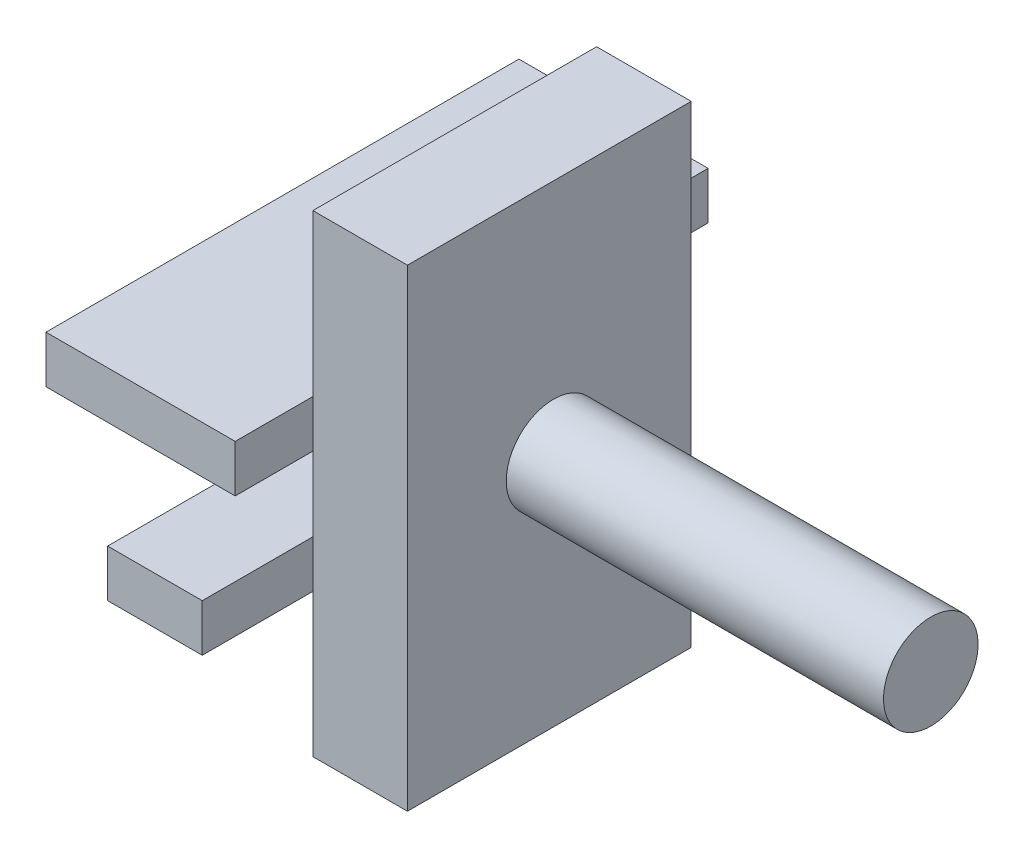
ISO-10303-21;
HEADER;
FILE_DESCRIPTION(('STEP AP214'),'2;1');
FILE_NAME('part.step','',(''),(''),'','','');
FILE_SCHEMA(('AUTOMOTIVE_DESIGN { 1 0 10303 214 1 1 1 1 }'));
ENDSEC;
DATA;
#1=APPLICATION_CONTEXT('core data for automotive mechanical design processes');
#2=APPLICATION_PROTOCOL_DEFINITION('international standard','automotive_design',2000,#1);
#3=PRODUCT_CONTEXT('',#1,'mechanical');
#4=PRODUCT('Part','Part','',(#3));
#5=PRODUCT_RELATED_PRODUCT_CATEGORY('part','',(#4));
#6=PRODUCT_DEFINITION_FORMATION('','',#4);
#7=PRODUCT_DEFINITION_CONTEXT('part definition',#1,'design');
#8=PRODUCT_DEFINITION('design','',#6,#7);
#9=PRODUCT_DEFINITION_SHAPE('','',#8);
#10=(LENGTH_UNIT() NAMED_UNIT(*) SI_UNIT(.MILLI.,.METRE.));
#11=(NAMED_UNIT(*) PLANE_ANGLE_UNIT() SI_UNIT($,.RADIAN.));
#12=(NAMED_UNIT(*) SI_UNIT($,.STERADIAN.) SOLID_ANGLE_UNIT());
#13=UNCERTAINTY_MEASURE_WITH_UNIT(LENGTH_MEASURE(1.E-05),#10,'distance_accuracy_value','');
#14=(GEOMETRIC_REPRESENTATION_CONTEXT(3) GLOBAL_UNCERTAINTY_ASSIGNED_CONTEXT((#13)) GLOBAL_UNIT_ASSIGNED_CONTEXT((#10,
#11,#12)) REPRESENTATION_CONTEXT('',''));
#15=CARTESIAN_POINT('',(0.,0.,0.));
#16=DIRECTION('',(0.,0.,1.));
#17=DIRECTION('',(1.,0.,0.));
#18=AXIS2_PLACEMENT_3D('',#15,#16,#17);
#19=CARTESIAN_POINT('',(12.892881308441,-3.34735781874821,51.5878251474294));
#20=DIRECTION('',(0.,1.,0.));
#21=DIRECTION('',(-1.,0.,0.));
#22=AXIS2_PLACEMENT_3D('',#19,#20,#21);
#23=PLANE('',#22);
#24=DIRECTION('',(0.,0.,-1.));
#25=VECTOR('',#24,1.);
#26=CARTESIAN_POINT('',(2.89288130844102,-3.34735781874824,51.5878251474294));
#27=LINE('',#26,#25);
#28=CARTESIAN_POINT('',(2.89288130844102,-3.34735781874824,51.5878251474294));
#29=VERTEX_POINT('',#28);
#30=CARTESIAN_POINT('',(2.89288130844102,-3.34735781874814,21.5878251474294));
#31=VERTEX_POINT('',#30);
#32=EDGE_CURVE('P0_E80',#29,#31,#27,.T.);
#33=ORIENTED_EDGE('',*,*,#32,.T.);
#34=DIRECTION('',(-1.,0.,0.));
#35=VECTOR('',#34,1.);
#36=CARTESIAN_POINT('',(12.892881308441,-3.34735781874811,21.5878251474294));
#37=LINE('',#36,#35);
#38=CARTESIAN_POINT('',(12.892881308441,-3.34735781874811,21.5878251474294));
#39=VERTEX_POINT('',#38);
#40=EDGE_CURVE('P0_E11',#39,#31,#37,.T.);
#41=ORIENTED_EDGE('',*,*,#40,.F.);
#42=DIRECTION('',(0.,0.,-1.));
#43=VECTOR('',#42,1.);
#44=CARTESIAN_POINT('',(12.892881308441,-3.34735781874821,51.5878251474294));
#45=LINE('',#44,#43);
#46=CARTESIAN_POINT('',(12.892881308441,-3.34735781874821,51.5878251474294));
#47=VERTEX_POINT('',#46);
#48=EDGE_CURVE('P0_E68',#47,#39,#45,.T.);
#49=ORIENTED_EDGE('',*,*,#48,.F.);
#50=DIRECTION('',(-1.,0.,0.));
#51=VECTOR('',#50,1.);
#52=CARTESIAN_POINT('',(12.892881308441,-3.34735781874821,51.5878251474294));
#53=LINE('',#52,#51);
#54=EDGE_CURVE('P0_E76',#47,#29,#53,.T.);
#55=ORIENTED_EDGE('',*,*,#54,.T.);
#56=EDGE_LOOP('',(#33,#41,#49,#55));
#57=FACE_BOUND('',#56,.T.);
#58=ADVANCED_FACE('P0_F17',(#57),#23,.F.);
#59=CARTESIAN_POINT('',(12.892881308441,-3.34735781874811,21.5878251474294));
#60=DIRECTION('',(0.,0.,1.));
#61=DIRECTION('',(0.,-1.,0.));
#62=AXIS2_PLACEMENT_3D('',#59,#60,#61);
#63=PLANE('',#62);
#64=DIRECTION('',(0.,1.,0.));
#65=VECTOR('',#64,1.);
#66=CARTESIAN_POINT('',(2.89288130844102,-3.34735781874814,21.5878251474294));
#67=LINE('',#66,#65);
#68=CARTESIAN_POINT('',(2.89288130844085,46.6526421812519,21.5878251474296));
#69=VERTEX_POINT('',#68);
#70=EDGE_CURVE('P0_E72',#31,#69,#67,.T.);
#71=ORIENTED_EDGE('',*,*,#70,.T.);
#72=DIRECTION('',(-1.,0.,0.));
#73=VECTOR('',#72,1.);
#74=CARTESIAN_POINT('',(12.8928813084408,46.6526421812519,21.5878251474296));
#75=LINE('',#74,#73);
#76=CARTESIAN_POINT('',(12.8928813084408,46.6526421812519,21.5878251474296));
#77=VERTEX_POINT('',#76);
#78=EDGE_CURVE('P0_E25',#77,#69,#75,.T.);
#79=ORIENTED_EDGE('',*,*,#78,.F.);
#80=DIRECTION('',(0.,1.,0.));
#81=VECTOR('',#80,1.);
#82=CARTESIAN_POINT('',(12.892881308441,-3.34735781874811,21.5878251474294));
#83=LINE('',#82,#81);
#84=EDGE_CURVE('P0_E63',#39,#77,#83,.T.);
#85=ORIENTED_EDGE('',*,*,#84,.F.);
#86=ORIENTED_EDGE('',*,*,#40,.T.);
#87=EDGE_LOOP('',(#71,#79,#85,#86));
#88=FACE_BOUND('',#87,.T.);
#89=ADVANCED_FACE('P0_F71',(#88),#63,.F.);
#90=CARTESIAN_POINT('',(12.8928813084408,46.6526421812518,51.5878251474296));
#91=DIRECTION('',(0.,-1.,0.));
#92=DIRECTION('',(1.,0.,0.));
#93=AXIS2_PLACEMENT_3D('',#90,#91,#92);
#94=PLANE('',#93);
#95=DIRECTION('',(0.,0.,1.));
#96=VECTOR('',#95,1.);
#97=CARTESIAN_POINT('',(2.89288130844085,46.6526421812518,51.5878251474296));
#98=LINE('',#97,#96);
#99=CARTESIAN_POINT('',(2.89288130844085,46.6526421812518,51.5878251474296));
#100=VERTEX_POINT('',#99);
#101=EDGE_CURVE('P0_E50',#69,#100,#98,.T.);
#102=ORIENTED_EDGE('',*,*,#101,.T.);
#103=DIRECTION('',(-1.,0.,0.));
#104=VECTOR('',#103,1.);
#105=CARTESIAN_POINT('',(12.8928813084408,46.6526421812518,51.5878251474296));
#106=LINE('',#105,#104);
#107=CARTESIAN_POINT('',(12.8928813084408,46.6526421812518,51.5878251474296));
#108=VERTEX_POINT('',#107);
#109=EDGE_CURVE('P0_E73',#108,#100,#106,.T.);
#110=ORIENTED_EDGE('',*,*,#109,.F.);
#111=DIRECTION('',(0.,0.,1.));
#112=VECTOR('',#111,1.);
#113=CARTESIAN_POINT('',(12.8928813084408,46.6526421812518,51.5878251474296));
#114=LINE('',#113,#112);
#115=EDGE_CURVE('P0_E66',#77,#108,#114,.T.);
#116=ORIENTED_EDGE('',*,*,#115,.F.);
#117=ORIENTED_EDGE('',*,*,#78,.T.);
#118=EDGE_LOOP('',(#102,#110,#116,#117));
#119=FACE_BOUND('',#118,.T.);
#120=ADVANCED_FACE('P0_F74',(#119),#94,.F.);
#121=CARTESIAN_POINT('',(12.892881308441,-3.34735781874821,51.5878251474294));
#122=DIRECTION('',(0.,0.,-1.));
#123=DIRECTION('',(-1.,0.,0.));
#124=AXIS2_PLACEMENT_3D('',#121,#122,#123);
#125=PLANE('',#124);
#126=DIRECTION('',(0.,-1.,0.));
#127=VECTOR('',#126,1.);
#128=CARTESIAN_POINT('',(2.89288130844102,-3.34735781874824,51.5878251474294));
#129=LINE('',#128,#127);
#130=EDGE_CURVE('P0_E56',#100,#29,#129,.T.);
#131=ORIENTED_EDGE('',*,*,#130,.T.);
#132=ORIENTED_EDGE('',*,*,#54,.F.);
#133=DIRECTION('',(0.,-1.,0.));
#134=VECTOR('',#133,1.);
#135=CARTESIAN_POINT('',(12.892881308441,-3.34735781874821,51.5878251474294));
#136=LINE('',#135,#134);
#137=EDGE_CURVE('P0_E33',#108,#47,#136,.T.);
#138=ORIENTED_EDGE('',*,*,#137,.F.);
#139=ORIENTED_EDGE('',*,*,#109,.T.);
#140=EDGE_LOOP('',(#131,#132,#138,#139));
#141=FACE_BOUND('',#140,.T.);
#142=ADVANCED_FACE('P0_F88',(#141),#125,.F.);
#143=CARTESIAN_POINT('',(12.892881308441,-1.30876863733646,51.5878251474294));
#144=DIRECTION('',(1.,0.,0.));
#145=DIRECTION('',(0.,1.,0.));
#146=AXIS2_PLACEMENT_3D('',#143,#144,#145);
#147=PLANE('',#146);
#148=CARTESIAN_POINT('',(12.8928813084409,21.6593369422146,36.1397737543822));
#149=DIRECTION('',(1.,0.,0.));
#150=DIRECTION('',(0.,1.,0.));
#151=AXIS2_PLACEMENT_3D('',#148,#149,#150);
#152=CIRCLE('',#151,2.5);
#153=CARTESIAN_POINT('',(12.8928813084409,24.1593369422146,36.1397737543822));
#154=VERTEX_POINT('',#153);
#155=EDGE_CURVE('P0_E94',#154,#154,#152,.T.);
#156=ORIENTED_EDGE('',*,*,#155,.F.);
#157=EDGE_LOOP('',(#156));
#158=FACE_BOUND('',#157,.T.);
#159=ORIENTED_EDGE('',*,*,#48,.T.);
#160=ORIENTED_EDGE('',*,*,#84,.T.);
#161=ORIENTED_EDGE('',*,*,#115,.T.);
#162=ORIENTED_EDGE('',*,*,#137,.T.);
#163=EDGE_LOOP('',(#159,#160,#161,#162));
#164=FACE_BOUND('',#163,.T.);
#165=ADVANCED_FACE('P0_F64',(#158,#164),#147,.T.);
#166=CARTESIAN_POINT('',(2.89288130844102,-1.30876863733649,51.5878251474294));
#167=DIRECTION('',(1.,0.,0.));
#168=DIRECTION('',(0.,1.,0.));
#169=AXIS2_PLACEMENT_3D('',#166,#167,#168);
#170=PLANE('',#169);
#171=CARTESIAN_POINT('',(2.89288130844094,21.6593369422145,36.1397737543822));
#172=DIRECTION('',(1.,0.,0.));
#173=DIRECTION('',(0.,1.,0.));
#174=AXIS2_PLACEMENT_3D('',#171,#172,#173);
#175=CIRCLE('',#174,2.5);
#176=CARTESIAN_POINT('',(2.89288130844093,24.1593369422145,36.1397737543822));
#177=VERTEX_POINT('',#176);
#178=EDGE_CURVE('P0_E83',#177,#177,#175,.T.);
#179=ORIENTED_EDGE('',*,*,#178,.T.);
#180=EDGE_LOOP('',(#179));
#181=FACE_BOUND('',#180,.T.);
#182=ORIENTED_EDGE('',*,*,#32,.F.);
#183=ORIENTED_EDGE('',*,*,#130,.F.);
#184=ORIENTED_EDGE('',*,*,#101,.F.);
#185=ORIENTED_EDGE('',*,*,#70,.F.);
#186=EDGE_LOOP('',(#182,#183,#184,#185));
#187=FACE_BOUND('',#186,.T.);
#188=ADVANCED_FACE('P0_F91',(#181,#187),#170,.F.);
#189=CARTESIAN_POINT('',(2.89288130844094,21.6593369422145,36.1397737543822));
#190=DIRECTION('',(1.,0.,0.));
#191=DIRECTION('',(0.,1.,0.));
#192=AXIS2_PLACEMENT_3D('',#189,#190,#191);
#193=CYLINDRICAL_SURFACE('',#192,2.5);
#194=ORIENTED_EDGE('',*,*,#178,.F.);
#195=EDGE_LOOP('',(#194));
#196=FACE_BOUND('',#195,.T.);
#197=ORIENTED_EDGE('',*,*,#155,.T.);
#198=EDGE_LOOP('',(#197));
#199=FACE_BOUND('',#198,.T.);
#200=ADVANCED_FACE('P0_F101',(#196,#199),#193,.F.);
#201=CLOSED_SHELL('',(#58,#89,#120,#142,#165,#188,#200));
#202=MANIFOLD_SOLID_BREP('P0_B1',#201);
#203=CARTESIAN_POINT('',(-17.1071186915591,29.6253206980531,59.8005578846722));
#204=DIRECTION('',(0.,0.,-1.));
#205=DIRECTION('',(0.,-1.,0.));
#206=AXIS2_PLACEMENT_3D('',#203,#204,#205);
#207=PLANE('',#206);
#208=DIRECTION('',(1.,0.,0.));
#209=VECTOR('',#208,1.);
#210=CARTESIAN_POINT('',(-17.1071186915591,24.6253206980531,59.8005578846722));
#211=LINE('',#210,#209);
#212=CARTESIAN_POINT('',(-17.1071186915591,24.6253206980531,59.8005578846722));
#213=VERTEX_POINT('',#212);
#214=CARTESIAN_POINT('',(2.89288130844093,24.6253206980532,59.8005578846722));
#215=VERTEX_POINT('',#214);
#216=EDGE_CURVE('P1_E79',#213,#215,#211,.T.);
#217=ORIENTED_EDGE('',*,*,#216,.T.);
#218=DIRECTION('',(0.,-1.,0.));
#219=VECTOR('',#218,1.);
#220=CARTESIAN_POINT('',(2.89288130844091,29.6253206980532,59.8005578846722));
#221=LINE('',#220,#219);
#222=CARTESIAN_POINT('',(2.89288130844091,29.6253206980532,59.8005578846722));
#223=VERTEX_POINT('',#222);
#224=EDGE_CURVE('P1_E10',#223,#215,#221,.T.);
#225=ORIENTED_EDGE('',*,*,#224,.F.);
#226=DIRECTION('',(1.,0.,0.));
#227=VECTOR('',#226,1.);
#228=CARTESIAN_POINT('',(-17.1071186915591,29.6253206980531,59.8005578846722));
#229=LINE('',#228,#227);
#230=CARTESIAN_POINT('',(-17.1071186915591,29.6253206980531,59.8005578846722));
#231=VERTEX_POINT('',#230);
#232=EDGE_CURVE('P1_E67',#231,#223,#229,.T.);
#233=ORIENTED_EDGE('',*,*,#232,.F.);
#234=DIRECTION('',(0.,-1.,0.));
#235=VECTOR('',#234,1.);
#236=CARTESIAN_POINT('',(-17.1071186915591,29.6253206980531,59.8005578846722));
#237=LINE('',#236,#235);
#238=EDGE_CURVE('P1_E75',#231,#213,#237,.T.);
#239=ORIENTED_EDGE('',*,*,#238,.T.);
#240=EDGE_LOOP('',(#217,#225,#233,#239));
#241=FACE_BOUND('',#240,.T.);
#242=ADVANCED_FACE('P1_F16',(#241),#207,.F.);
#243=CARTESIAN_POINT('',(2.89288130844091,29.6253206980532,59.8005578846722));
#244=DIRECTION('',(-1.,0.,0.));
#245=DIRECTION('',(0.,1.,0.));
#246=AXIS2_PLACEMENT_3D('',#243,#244,#245);
#247=PLANE('',#246);
#248=DIRECTION('',(0.,0.,-1.));
#249=VECTOR('',#248,1.);
#250=CARTESIAN_POINT('',(2.89288130844093,24.6253206980532,59.8005578846722));
#251=LINE('',#250,#249);
#252=CARTESIAN_POINT('',(2.89288130844093,24.625320698053,9.80055788467222));
#253=VERTEX_POINT('',#252);
#254=EDGE_CURVE('P1_E71',#215,#253,#251,.T.);
#255=ORIENTED_EDGE('',*,*,#254,.T.);
#256=DIRECTION('',(0.,-1.,0.));
#257=VECTOR('',#256,1.);
#258=CARTESIAN_POINT('',(2.89288130844091,29.625320698053,9.8005578846722));
#259=LINE('',#258,#257);
#260=CARTESIAN_POINT('',(2.89288130844091,29.625320698053,9.8005578846722));
#261=VERTEX_POINT('',#260);
#262=EDGE_CURVE('P1_E24',#261,#253,#259,.T.);
#263=ORIENTED_EDGE('',*,*,#262,.F.);
#264=DIRECTION('',(0.,0.,-1.));
#265=VECTOR('',#264,1.);
#266=CARTESIAN_POINT('',(2.89288130844091,29.6253206980532,59.8005578846722));
#267=LINE('',#266,#265);
#268=EDGE_CURVE('P1_E62',#223,#261,#267,.T.);
#269=ORIENTED_EDGE('',*,*,#268,.F.);
#270=ORIENTED_EDGE('',*,*,#224,.T.);
#271=EDGE_LOOP('',(#255,#263,#269,#270));
#272=FACE_BOUND('',#271,.T.);
#273=ADVANCED_FACE('P1_F70',(#272),#247,.F.);
#274=CARTESIAN_POINT('',(-17.1071186915591,29.6253206980529,9.8005578846722));
#275=DIRECTION('',(0.,0.,1.));
#276=DIRECTION('',(0.,1.,0.));
#277=AXIS2_PLACEMENT_3D('',#274,#275,#276);
#278=PLANE('',#277);
#279=DIRECTION('',(-1.,0.,0.));
#280=VECTOR('',#279,1.);
#281=CARTESIAN_POINT('',(-17.1071186915591,24.6253206980529,9.80055788467222));
#282=LINE('',#281,#280);
#283=CARTESIAN_POINT('',(-17.1071186915591,24.6253206980529,9.80055788467222));
#284=VERTEX_POINT('',#283);
#285=EDGE_CURVE('P1_E49',#253,#284,#282,.T.);
#286=ORIENTED_EDGE('',*,*,#285,.T.);
#287=DIRECTION('',(0.,-1.,0.));
#288=VECTOR('',#287,1.);
#289=CARTESIAN_POINT('',(-17.1071186915591,29.6253206980529,9.8005578846722));
#290=LINE('',#289,#288);
#291=CARTESIAN_POINT('',(-17.1071186915591,29.6253206980529,9.8005578846722));
#292=VERTEX_POINT('',#291);
#293=EDGE_CURVE('P1_E72',#292,#284,#290,.T.);
#294=ORIENTED_EDGE('',*,*,#293,.F.);
#295=DIRECTION('',(-1.,0.,0.));
#296=VECTOR('',#295,1.);
#297=CARTESIAN_POINT('',(-17.1071186915591,29.6253206980529,9.8005578846722));
#298=LINE('',#297,#296);
#299=EDGE_CURVE('P1_E65',#261,#292,#298,.T.);
#300=ORIENTED_EDGE('',*,*,#299,.F.);
#301=ORIENTED_EDGE('',*,*,#262,.T.);
#302=EDGE_LOOP('',(#286,#294,#300,#301));
#303=FACE_BOUND('',#302,.T.);
#304=ADVANCED_FACE('P1_F73',(#303),#278,.F.);
#305=CARTESIAN_POINT('',(-17.1071186915591,29.6253206980531,59.8005578846722));
#306=DIRECTION('',(1.,0.,0.));
#307=DIRECTION('',(0.,-1.,0.));
#308=AXIS2_PLACEMENT_3D('',#305,#306,#307);
#309=PLANE('',#308);
#310=DIRECTION('',(0.,0.,1.));
#311=VECTOR('',#310,1.);
#312=CARTESIAN_POINT('',(-17.1071186915591,24.6253206980531,59.8005578846722));
#313=LINE('',#312,#311);
#314=EDGE_CURVE('P1_E55',#284,#213,#313,.T.);
#315=ORIENTED_EDGE('',*,*,#314,.T.);
#316=ORIENTED_EDGE('',*,*,#238,.F.);
#317=DIRECTION('',(0.,0.,1.));
#318=VECTOR('',#317,1.);
#319=CARTESIAN_POINT('',(-17.1071186915591,29.6253206980531,59.8005578846722));
#320=LINE('',#319,#318);
#321=EDGE_CURVE('P1_E32',#292,#231,#320,.T.);
#322=ORIENTED_EDGE('',*,*,#321,.F.);
#323=ORIENTED_EDGE('',*,*,#293,.T.);
#324=EDGE_LOOP('',(#315,#316,#322,#323));
#325=FACE_BOUND('',#324,.T.);
#326=ADVANCED_FACE('P1_F86',(#325),#309,.F.);
#327=CARTESIAN_POINT('',(-17.1071186915591,29.6253206980531,59.8005578846722));
#328=DIRECTION('',(0.,1.,0.));
#329=DIRECTION('',(0.,0.,-1.));
#330=AXIS2_PLACEMENT_3D('',#327,#328,#329);
#331=PLANE('',#330);
#332=ORIENTED_EDGE('',*,*,#232,.T.);
#333=ORIENTED_EDGE('',*,*,#268,.T.);
#334=ORIENTED_EDGE('',*,*,#299,.T.);
#335=ORIENTED_EDGE('',*,*,#321,.T.);
#336=EDGE_LOOP('',(#332,#333,#334,#335));
#337=FACE_BOUND('',#336,.T.);
#338=ADVANCED_FACE('P1_F63',(#337),#331,.T.);
#339=CARTESIAN_POINT('',(-17.1071186915591,24.6253206980531,59.8005578846722));
#340=DIRECTION('',(0.,1.,0.));
#341=DIRECTION('',(0.,0.,-1.));
#342=AXIS2_PLACEMENT_3D('',#339,#340,#341);
#343=PLANE('',#342);
#344=ORIENTED_EDGE('',*,*,#216,.F.);
#345=ORIENTED_EDGE('',*,*,#314,.F.);
#346=ORIENTED_EDGE('',*,*,#285,.F.);
#347=ORIENTED_EDGE('',*,*,#254,.F.);
#348=EDGE_LOOP('',(#344,#345,#346,#347));
#349=FACE_BOUND('',#348,.T.);
#350=ADVANCED_FACE('P1_F89',(#349),#343,.F.);
#351=CLOSED_SHELL('',(#242,#273,#304,#326,#338,#350));
#352=MANIFOLD_SOLID_BREP('P1_B1',#351);
#353=CARTESIAN_POINT('',(2.77510659368166,21.6593369422145,36.1397737543822));
#354=DIRECTION('',(-1.,0.,0.));
#355=DIRECTION('',(0.,-0.717446984380104,-0.696613109698558));
#356=AXIS2_PLACEMENT_3D('',#353,#354,#355);
#357=CYLINDRICAL_SURFACE('',#356,5.);
#358=CARTESIAN_POINT('',(52.7751065936817,21.6593369422147,36.1397737543822));
#359=DIRECTION('',(-1.,0.,0.));
#360=DIRECTION('',(0.,-0.717446984380104,-0.696613109698558));
#361=AXIS2_PLACEMENT_3D('',#358,#359,#360);
#362=CIRCLE('',#361,5.);
#363=CARTESIAN_POINT('',(52.7751065936817,18.0721020203142,32.6567082058894));
#364=VERTEX_POINT('',#363);
#365=EDGE_CURVE('P2_E21',#364,#364,#362,.T.);
#366=ORIENTED_EDGE('',*,*,#365,.T.);
#367=EDGE_LOOP('',(#366));
#368=FACE_BOUND('',#367,.T.);
#369=CARTESIAN_POINT('',(2.77510659368166,21.6593369422145,36.1397737543822));
#370=DIRECTION('',(-1.,0.,0.));
#371=DIRECTION('',(0.,-0.717446984380104,-0.696613109698558));
#372=AXIS2_PLACEMENT_3D('',#369,#370,#371);
#373=CIRCLE('',#372,5.);
#374=CARTESIAN_POINT('',(2.77510659368168,18.072102020314,32.6567082058894));
#375=VERTEX_POINT('',#374);
#376=EDGE_CURVE('P2_E10',#375,#375,#373,.T.);
#377=ORIENTED_EDGE('',*,*,#376,.F.);
#378=EDGE_LOOP('',(#377));
#379=FACE_BOUND('',#378,.T.);
#380=ADVANCED_FACE('P2_F15',(#368,#379),#357,.T.);
#381=CARTESIAN_POINT('',(2.77510659368165,25.1424024907073,32.5525388324817));
#382=DIRECTION('',(1.,0.,0.));
#383=DIRECTION('',(0.,0.717446984380104,0.696613109698558));
#384=AXIS2_PLACEMENT_3D('',#381,#382,#383);
#385=PLANE('',#384);
#386=ORIENTED_EDGE('',*,*,#376,.T.);
#387=EDGE_LOOP('',(#386));
#388=FACE_BOUND('',#387,.T.);
#389=ADVANCED_FACE('P2_F31',(#388),#385,.F.);
#390=CARTESIAN_POINT('',(52.7751065936817,21.6593369422147,36.1397737543822));
#391=DIRECTION('',(-1.,0.,0.));
#392=DIRECTION('',(0.,-0.717446984380104,-0.696613109698558));
#393=AXIS2_PLACEMENT_3D('',#390,#391,#392);
#394=PLANE('',#393);
#395=ORIENTED_EDGE('',*,*,#365,.F.);
#396=EDGE_LOOP('',(#395));
#397=FACE_BOUND('',#396,.T.);
#398=ADVANCED_FACE('P2_F29',(#397),#394,.F.);
#399=CLOSED_SHELL('',(#380,#389,#398));
#400=MANIFOLD_SOLID_BREP('P2_B1',#399);
#401=CARTESIAN_POINT('',(-7.10711869155905,16.7811179146093,63.2818628801897));
#402=DIRECTION('',(0.,0.,-1.));
#403=DIRECTION('',(0.,-1.,0.));
#404=AXIS2_PLACEMENT_3D('',#401,#402,#403);
#405=PLANE('',#404);
#406=DIRECTION('',(1.,0.,0.));
#407=VECTOR('',#406,1.);
#408=CARTESIAN_POINT('',(-7.10711869155903,11.7811179146093,63.2818628801897));
#409=LINE('',#408,#407);
#410=CARTESIAN_POINT('',(-7.10711869155903,11.7811179146093,63.2818628801897));
#411=VERTEX_POINT('',#410);
#412=CARTESIAN_POINT('',(2.89288130844097,11.7811179146093,63.2818628801897));
#413=VERTEX_POINT('',#412);
#414=EDGE_CURVE('P3_E80',#411,#413,#409,.T.);
#415=ORIENTED_EDGE('',*,*,#414,.T.);
#416=DIRECTION('',(0.,-1.,0.));
#417=VECTOR('',#416,1.);
#418=CARTESIAN_POINT('',(2.89288130844096,16.7811179146093,63.2818628801897));
#419=LINE('',#418,#417);
#420=CARTESIAN_POINT('',(2.89288130844096,16.7811179146093,63.2818628801897));
#421=VERTEX_POINT('',#420);
#422=EDGE_CURVE('P3_E11',#421,#413,#419,.T.);
#423=ORIENTED_EDGE('',*,*,#422,.F.);
#424=DIRECTION('',(1.,0.,0.));
#425=VECTOR('',#424,1.);
#426=CARTESIAN_POINT('',(-7.10711869155905,16.7811179146093,63.2818628801897));
#427=LINE('',#426,#425);
#428=CARTESIAN_POINT('',(-7.10711869155905,16.7811179146093,63.2818628801897));
#429=VERTEX_POINT('',#428);
#430=EDGE_CURVE('P3_E68',#429,#421,#427,.T.);
#431=ORIENTED_EDGE('',*,*,#430,.F.);
#432=DIRECTION('',(0.,-1.,0.));
#433=VECTOR('',#432,1.);
#434=CARTESIAN_POINT('',(-7.10711869155905,16.7811179146093,63.2818628801897));
#435=LINE('',#434,#433);
#436=EDGE_CURVE('P3_E76',#429,#411,#435,.T.);
#437=ORIENTED_EDGE('',*,*,#436,.T.);
#438=EDGE_LOOP('',(#415,#423,#431,#437));
#439=FACE_BOUND('',#438,.T.);
#440=ADVANCED_FACE('P3_F17',(#439),#405,.F.);
#441=CARTESIAN_POINT('',(2.89288130844096,16.7811179146093,63.2818628801897));
#442=DIRECTION('',(-1.,0.,0.));
#443=DIRECTION('',(0.,1.,0.));
#444=AXIS2_PLACEMENT_3D('',#441,#442,#443);
#445=PLANE('',#444);
#446=DIRECTION('',(0.,0.,-1.));
#447=VECTOR('',#446,1.);
#448=CARTESIAN_POINT('',(2.89288130844097,11.7811179146093,63.2818628801897));
#449=LINE('',#448,#447);
#450=CARTESIAN_POINT('',(2.89288130844097,11.7811179146092,13.2818628801897));
#451=VERTEX_POINT('',#450);
#452=EDGE_CURVE('P3_E72',#413,#451,#449,.T.);
#453=ORIENTED_EDGE('',*,*,#452,.T.);
#454=DIRECTION('',(0.,-1.,0.));
#455=VECTOR('',#454,1.);
#456=CARTESIAN_POINT('',(2.89288130844096,16.7811179146092,13.2818628801897));
#457=LINE('',#456,#455);
#458=CARTESIAN_POINT('',(2.89288130844096,16.7811179146092,13.2818628801897));
#459=VERTEX_POINT('',#458);
#460=EDGE_CURVE('P3_E25',#459,#451,#457,.T.);
#461=ORIENTED_EDGE('',*,*,#460,.F.);
#462=DIRECTION('',(0.,0.,-1.));
#463=VECTOR('',#462,1.);
#464=CARTESIAN_POINT('',(2.89288130844096,16.7811179146093,63.2818628801897));
#465=LINE('',#464,#463);
#466=EDGE_CURVE('P3_E63',#421,#459,#465,.T.);
#467=ORIENTED_EDGE('',*,*,#466,.F.);
#468=ORIENTED_EDGE('',*,*,#422,.T.);
#469=EDGE_LOOP('',(#453,#461,#467,#468));
#470=FACE_BOUND('',#469,.T.);
#471=ADVANCED_FACE('P3_F71',(#470),#445,.F.);
#472=CARTESIAN_POINT('',(-7.10711869155905,16.7811179146091,13.2818628801897));
#473=DIRECTION('',(0.,0.,1.));
#474=DIRECTION('',(0.,1.,0.));
#475=AXIS2_PLACEMENT_3D('',#472,#473,#474);
#476=PLANE('',#475);
#477=DIRECTION('',(-1.,0.,0.));
#478=VECTOR('',#477,1.);
#479=CARTESIAN_POINT('',(-7.10711869155903,11.7811179146091,13.2818628801897));
#480=LINE('',#479,#478);
#481=CARTESIAN_POINT('',(-7.10711869155903,11.7811179146091,13.2818628801897));
#482=VERTEX_POINT('',#481);
#483=EDGE_CURVE('P3_E50',#451,#482,#480,.T.);
#484=ORIENTED_EDGE('',*,*,#483,.T.);
#485=DIRECTION('',(0.,-1.,0.));
#486=VECTOR('',#485,1.);
#487=CARTESIAN_POINT('',(-7.10711869155905,16.7811179146091,13.2818628801897));
#488=LINE('',#487,#486);
#489=CARTESIAN_POINT('',(-7.10711869155905,16.7811179146091,13.2818628801897));
#490=VERTEX_POINT('',#489);
#491=EDGE_CURVE('P3_E73',#490,#482,#488,.T.);
#492=ORIENTED_EDGE('',*,*,#491,.F.);
#493=DIRECTION('',(-1.,0.,0.));
#494=VECTOR('',#493,1.);
#495=CARTESIAN_POINT('',(-7.10711869155905,16.7811179146091,13.2818628801897));
#496=LINE('',#495,#494);
#497=EDGE_CURVE('P3_E66',#459,#490,#496,.T.);
#498=ORIENTED_EDGE('',*,*,#497,.F.);
#499=ORIENTED_EDGE('',*,*,#460,.T.);
#500=EDGE_LOOP('',(#484,#492,#498,#499));
#501=FACE_BOUND('',#500,.T.);
#502=ADVANCED_FACE('P3_F74',(#501),#476,.F.);
#503=CARTESIAN_POINT('',(-7.10711869155905,16.7811179146093,63.2818628801897));
#504=DIRECTION('',(1.,0.,0.));
#505=DIRECTION('',(0.,-1.,0.));
#506=AXIS2_PLACEMENT_3D('',#503,#504,#505);
#507=PLANE('',#506);
#508=DIRECTION('',(0.,0.,1.));
#509=VECTOR('',#508,1.);
#510=CARTESIAN_POINT('',(-7.10711869155903,11.7811179146093,63.2818628801897));
#511=LINE('',#510,#509);
#512=EDGE_CURVE('P3_E56',#482,#411,#511,.T.);
#513=ORIENTED_EDGE('',*,*,#512,.T.);
#514=ORIENTED_EDGE('',*,*,#436,.F.);
#515=DIRECTION('',(0.,0.,1.));
#516=VECTOR('',#515,1.);
#517=CARTESIAN_POINT('',(-7.10711869155905,16.7811179146093,63.2818628801897));
#518=LINE('',#517,#516);
#519=EDGE_CURVE('P3_E33',#490,#429,#518,.T.);
#520=ORIENTED_EDGE('',*,*,#519,.F.);
#521=ORIENTED_EDGE('',*,*,#491,.T.);
#522=EDGE_LOOP('',(#513,#514,#520,#521));
#523=FACE_BOUND('',#522,.T.);
#524=ADVANCED_FACE('P3_F87',(#523),#507,.F.);
#525=CARTESIAN_POINT('',(-7.10711869155905,16.7811179146093,63.2818628801897));
#526=DIRECTION('',(0.,1.,0.));
#527=DIRECTION('',(0.,0.,-1.));
#528=AXIS2_PLACEMENT_3D('',#525,#526,#527);
#529=PLANE('',#528);
#530=ORIENTED_EDGE('',*,*,#430,.T.);
#531=ORIENTED_EDGE('',*,*,#466,.T.);
#532=ORIENTED_EDGE('',*,*,#497,.T.);
#533=ORIENTED_EDGE('',*,*,#519,.T.);
#534=EDGE_LOOP('',(#530,#531,#532,#533));
#535=FACE_BOUND('',#534,.T.);
#536=ADVANCED_FACE('P3_F64',(#535),#529,.T.);
#537=CARTESIAN_POINT('',(-7.10711869155903,11.7811179146093,63.2818628801897));
#538=DIRECTION('',(0.,1.,0.));
#539=DIRECTION('',(0.,0.,-1.));
#540=AXIS2_PLACEMENT_3D('',#537,#538,#539);
#541=PLANE('',#540);
#542=ORIENTED_EDGE('',*,*,#414,.F.);
#543=ORIENTED_EDGE('',*,*,#512,.F.);
#544=ORIENTED_EDGE('',*,*,#483,.F.);
#545=ORIENTED_EDGE('',*,*,#452,.F.);
#546=EDGE_LOOP('',(#542,#543,#544,#545));
#547=FACE_BOUND('',#546,.T.);
#548=ADVANCED_FACE('P3_F90',(#547),#541,.F.);
#549=CLOSED_SHELL('',(#440,#471,#502,#524,#536,#548));
#550=MANIFOLD_SOLID_BREP('P3_B1',#549);
#551=ADVANCED_BREP_SHAPE_REPRESENTATION('',(#18,#202,#352,#400,#550),#14);
#552=SHAPE_DEFINITION_REPRESENTATION(#9,#551);
ENDSEC;
END-ISO-10303-21;
